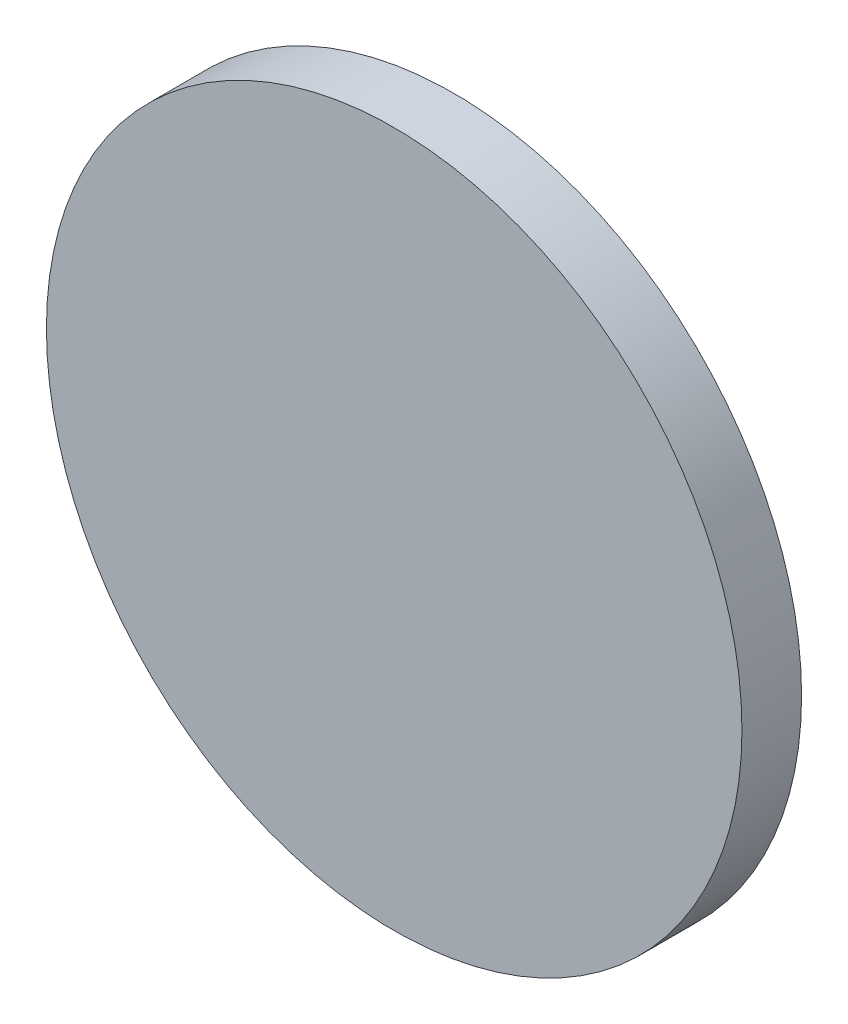
ISO-10303-21;
HEADER;
FILE_DESCRIPTION(('STEP AP214'),'2;1');
FILE_NAME('part.step','',(''),(''),'','','');
FILE_SCHEMA(('AUTOMOTIVE_DESIGN { 1 0 10303 214 1 1 1 1 }'));
ENDSEC;
DATA;
#1=APPLICATION_CONTEXT('core data for automotive mechanical design processes');
#2=APPLICATION_PROTOCOL_DEFINITION('international standard','automotive_design',2000,#1);
#3=PRODUCT_CONTEXT('',#1,'mechanical');
#4=PRODUCT('Part','Part','',(#3));
#5=PRODUCT_RELATED_PRODUCT_CATEGORY('part','',(#4));
#6=PRODUCT_DEFINITION_FORMATION('','',#4);
#7=PRODUCT_DEFINITION_CONTEXT('part definition',#1,'design');
#8=PRODUCT_DEFINITION('design','',#6,#7);
#9=PRODUCT_DEFINITION_SHAPE('','',#8);
#10=(LENGTH_UNIT() NAMED_UNIT(*) SI_UNIT(.MILLI.,.METRE.));
#11=(NAMED_UNIT(*) PLANE_ANGLE_UNIT() SI_UNIT($,.RADIAN.));
#12=(NAMED_UNIT(*) SI_UNIT($,.STERADIAN.) SOLID_ANGLE_UNIT());
#13=UNCERTAINTY_MEASURE_WITH_UNIT(LENGTH_MEASURE(1.E-05),#10,'distance_accuracy_value','');
#14=(GEOMETRIC_REPRESENTATION_CONTEXT(3) GLOBAL_UNCERTAINTY_ASSIGNED_CONTEXT((#13)) GLOBAL_UNIT_ASSIGNED_CONTEXT((#10,
#11,#12)) REPRESENTATION_CONTEXT('',''));
#15=CARTESIAN_POINT('',(0.,0.,0.));
#16=DIRECTION('',(0.,0.,1.));
#17=DIRECTION('',(1.,0.,0.));
#18=AXIS2_PLACEMENT_3D('',#15,#16,#17);
#19=CARTESIAN_POINT('',(6.72846,4.59486,0.));
#20=DIRECTION('',(0.,0.,-1.));
#21=DIRECTION('',(-1.,0.,0.));
#22=AXIS2_PLACEMENT_3D('',#19,#20,#21);
#23=PLANE('',#22);
#24=CARTESIAN_POINT('',(6.72846,4.59486,0.));
#25=DIRECTION('',(0.,0.,1.));
#26=DIRECTION('',(1.,0.,0.));
#27=AXIS2_PLACEMENT_3D('',#24,#25,#26);
#28=CIRCLE('',#27,0.200024667);
#29=CARTESIAN_POINT('',(6.928484667,4.59486,0.));
#30=VERTEX_POINT('',#29);
#31=EDGE_CURVE('E18',#30,#30,#28,.T.);
#32=ORIENTED_EDGE('',*,*,#31,.F.);
#33=EDGE_LOOP('',(#32));
#34=FACE_BOUND('',#33,.T.);
#35=ADVANCED_FACE('F15',(#34),#23,.T.);
#36=CARTESIAN_POINT('',(6.72846,4.59486,0.));
#37=DIRECTION('',(0.,0.,1.));
#38=DIRECTION('',(1.,0.,0.));
#39=AXIS2_PLACEMENT_3D('',#36,#37,#38);
#40=CYLINDRICAL_SURFACE('',#39,0.200024667);
#41=CARTESIAN_POINT('',(6.72846,4.59486,0.03429));
#42=DIRECTION('',(0.,0.,1.));
#43=DIRECTION('',(1.,0.,0.));
#44=AXIS2_PLACEMENT_3D('',#41,#42,#43);
#45=CIRCLE('',#44,0.200024667);
#46=CARTESIAN_POINT('',(6.928484667,4.59486,0.03429));
#47=VERTEX_POINT('',#46);
#48=EDGE_CURVE('E10',#47,#47,#45,.T.);
#49=ORIENTED_EDGE('',*,*,#48,.F.);
#50=EDGE_LOOP('',(#49));
#51=FACE_BOUND('',#50,.T.);
#52=ORIENTED_EDGE('',*,*,#31,.T.);
#53=EDGE_LOOP('',(#52));
#54=FACE_BOUND('',#53,.T.);
#55=ADVANCED_FACE('F27',(#51,#54),#40,.T.);
#56=CARTESIAN_POINT('',(6.72846,4.59486,0.03429));
#57=DIRECTION('',(0.,0.,1.));
#58=DIRECTION('',(1.,0.,0.));
#59=AXIS2_PLACEMENT_3D('',#56,#57,#58);
#60=PLANE('',#59);
#61=ORIENTED_EDGE('',*,*,#48,.T.);
#62=EDGE_LOOP('',(#61));
#63=FACE_BOUND('',#62,.T.);
#64=ADVANCED_FACE('F34',(#63),#60,.T.);
#65=CLOSED_SHELL('',(#35,#55,#64));
#66=MANIFOLD_SOLID_BREP('B1',#65);
#67=ADVANCED_BREP_SHAPE_REPRESENTATION('',(#18,#66),#14);
#68=SHAPE_DEFINITION_REPRESENTATION(#9,#67);
ENDSEC;
END-ISO-10303-21;
